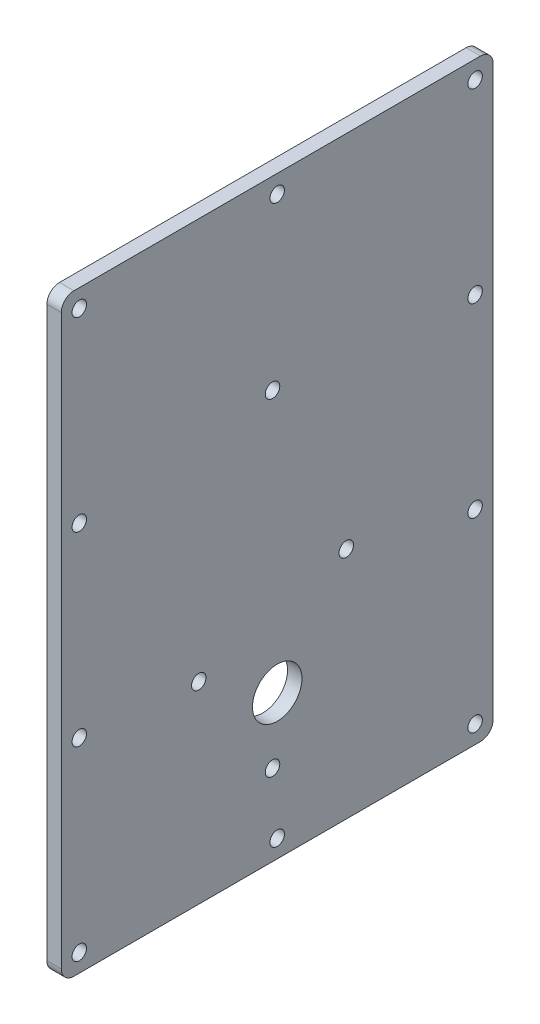
ISO-10303-21;
HEADER;
FILE_DESCRIPTION(('STEP AP214'),'2;1');
FILE_NAME('part.step','',(''),(''),'','','');
FILE_SCHEMA(('AUTOMOTIVE_DESIGN { 1 0 10303 214 1 1 1 1 }'));
ENDSEC;
DATA;
#1=APPLICATION_CONTEXT('core data for automotive mechanical design processes');
#2=APPLICATION_PROTOCOL_DEFINITION('international standard','automotive_design',2000,#1);
#3=PRODUCT_CONTEXT('',#1,'mechanical');
#4=PRODUCT('Part','Part','',(#3));
#5=PRODUCT_RELATED_PRODUCT_CATEGORY('part','',(#4));
#6=PRODUCT_DEFINITION_FORMATION('','',#4);
#7=PRODUCT_DEFINITION_CONTEXT('part definition',#1,'design');
#8=PRODUCT_DEFINITION('design','',#6,#7);
#9=PRODUCT_DEFINITION_SHAPE('','',#8);
#10=(LENGTH_UNIT() NAMED_UNIT(*) SI_UNIT(.MILLI.,.METRE.));
#11=(NAMED_UNIT(*) PLANE_ANGLE_UNIT() SI_UNIT($,.RADIAN.));
#12=(NAMED_UNIT(*) SI_UNIT($,.STERADIAN.) SOLID_ANGLE_UNIT());
#13=UNCERTAINTY_MEASURE_WITH_UNIT(LENGTH_MEASURE(1.E-05),#10,'distance_accuracy_value','');
#14=(GEOMETRIC_REPRESENTATION_CONTEXT(3) GLOBAL_UNCERTAINTY_ASSIGNED_CONTEXT((#13)) GLOBAL_UNIT_ASSIGNED_CONTEXT((#10,
#11,#12)) REPRESENTATION_CONTEXT('',''));
#15=CARTESIAN_POINT('',(0.,0.,0.));
#16=DIRECTION('',(0.,0.,1.));
#17=DIRECTION('',(1.,0.,0.));
#18=AXIS2_PLACEMENT_3D('',#15,#16,#17);
#19=CARTESIAN_POINT('',(0.,0.,0.));
#20=DIRECTION('',(-1.,0.,0.));
#21=DIRECTION('',(0.,0.,1.));
#22=AXIS2_PLACEMENT_3D('',#19,#20,#21);
#23=PLANE('',#22);
#24=CARTESIAN_POINT('',(0.,203.2,-6.35));
#25=DIRECTION('',(1.,0.,0.));
#26=DIRECTION('',(0.,0.,-1.));
#27=AXIS2_PLACEMENT_3D('',#24,#25,#26);
#28=CIRCLE('',#27,2.55269999999999);
#29=CARTESIAN_POINT('',(0.,203.2,-8.90269999999999));
#30=VERTEX_POINT('',#29);
#31=EDGE_CURVE('E265',#30,#30,#28,.T.);
#32=ORIENTED_EDGE('',*,*,#31,.T.);
#33=EDGE_LOOP('',(#32));
#34=FACE_BOUND('',#33,.T.);
#35=CARTESIAN_POINT('',(0.,6.35000000000003,-146.05));
#36=DIRECTION('',(1.,0.,0.));
#37=DIRECTION('',(0.,0.,-1.));
#38=AXIS2_PLACEMENT_3D('',#35,#36,#37);
#39=CIRCLE('',#38,2.5527);
#40=CARTESIAN_POINT('',(0.,6.35000000000003,-148.6027));
#41=VERTEX_POINT('',#40);
#42=EDGE_CURVE('E259',#41,#41,#39,.T.);
#43=ORIENTED_EDGE('',*,*,#42,.T.);
#44=EDGE_LOOP('',(#43));
#45=FACE_BOUND('',#44,.T.);
#46=DIRECTION('',(0.,0.,-1.));
#47=VECTOR('',#46,1.);
#48=CARTESIAN_POINT('',(0.,0.,0.));
#49=LINE('',#48,#47);
#50=CARTESIAN_POINT('',(0.,0.,-4.445));
#51=VERTEX_POINT('',#50);
#52=CARTESIAN_POINT('',(0.,0.,-147.955));
#53=VERTEX_POINT('',#52);
#54=EDGE_CURVE('E122',#51,#53,#49,.T.);
#55=ORIENTED_EDGE('',*,*,#54,.F.);
#56=CARTESIAN_POINT('',(0.,4.445,-4.445));
#57=DIRECTION('',(-1.,0.,0.));
#58=DIRECTION('',(0.,0.,1.));
#59=AXIS2_PLACEMENT_3D('',#56,#57,#58);
#60=CIRCLE('',#59,4.445);
#61=CARTESIAN_POINT('',(0.,4.445,0.));
#62=VERTEX_POINT('',#61);
#63=EDGE_CURVE('E105',#51,#62,#60,.T.);
#64=ORIENTED_EDGE('',*,*,#63,.T.);
#65=DIRECTION('',(0.,-1.,0.));
#66=VECTOR('',#65,1.);
#67=CARTESIAN_POINT('',(0.,0.,0.));
#68=LINE('',#67,#66);
#69=CARTESIAN_POINT('',(0.,205.105,0.));
#70=VERTEX_POINT('',#69);
#71=EDGE_CURVE('E132',#70,#62,#68,.T.);
#72=ORIENTED_EDGE('',*,*,#71,.F.);
#73=CARTESIAN_POINT('',(0.,205.105,-4.445));
#74=DIRECTION('',(-1.,0.,0.));
#75=DIRECTION('',(0.,0.,1.));
#76=AXIS2_PLACEMENT_3D('',#73,#74,#75);
#77=CIRCLE('',#76,4.445);
#78=CARTESIAN_POINT('',(0.,209.55,-4.445));
#79=VERTEX_POINT('',#78);
#80=EDGE_CURVE('E126',#70,#79,#77,.T.);
#81=ORIENTED_EDGE('',*,*,#80,.T.);
#82=DIRECTION('',(0.,0.,1.));
#83=VECTOR('',#82,1.);
#84=CARTESIAN_POINT('',(0.,209.55,0.));
#85=LINE('',#84,#83);
#86=CARTESIAN_POINT('',(0.,209.55,-147.955));
#87=VERTEX_POINT('',#86);
#88=EDGE_CURVE('E135',#87,#79,#85,.T.);
#89=ORIENTED_EDGE('',*,*,#88,.F.);
#90=CARTESIAN_POINT('',(0.,205.105,-147.955));
#91=DIRECTION('',(-1.,0.,0.));
#92=DIRECTION('',(0.,0.,1.));
#93=AXIS2_PLACEMENT_3D('',#90,#91,#92);
#94=CIRCLE('',#93,4.445);
#95=CARTESIAN_POINT('',(0.,205.105,-152.4));
#96=VERTEX_POINT('',#95);
#97=EDGE_CURVE('E146',#87,#96,#94,.T.);
#98=ORIENTED_EDGE('',*,*,#97,.T.);
#99=DIRECTION('',(0.,1.,0.));
#100=VECTOR('',#99,1.);
#101=CARTESIAN_POINT('',(0.,0.,-152.4));
#102=LINE('',#101,#100);
#103=CARTESIAN_POINT('',(0.,4.445,-152.4));
#104=VERTEX_POINT('',#103);
#105=EDGE_CURVE('E131',#104,#96,#102,.T.);
#106=ORIENTED_EDGE('',*,*,#105,.F.);
#107=CARTESIAN_POINT('',(0.,4.445,-147.955));
#108=DIRECTION('',(-1.,0.,0.));
#109=DIRECTION('',(0.,0.,1.));
#110=AXIS2_PLACEMENT_3D('',#107,#108,#109);
#111=CIRCLE('',#110,4.445);
#112=EDGE_CURVE('E116',#104,#53,#111,.T.);
#113=ORIENTED_EDGE('',*,*,#112,.T.);
#114=EDGE_LOOP('',(#55,#64,#72,#81,#89,#98,#106,#113));
#115=FACE_BOUND('',#114,.T.);
#116=CARTESIAN_POINT('',(0.,50.8000000000041,-76.2));
#117=DIRECTION('',(1.,0.,0.));
#118=DIRECTION('',(0.,0.,-1.));
#119=AXIS2_PLACEMENT_3D('',#116,#117,#118);
#120=CIRCLE('',#119,8.73125);
#121=CARTESIAN_POINT('',(0.,50.8000000000041,-84.93125));
#122=VERTEX_POINT('',#121);
#123=EDGE_CURVE('E137',#122,#122,#120,.T.);
#124=ORIENTED_EDGE('',*,*,#123,.T.);
#125=EDGE_LOOP('',(#124));
#126=FACE_BOUND('',#125,.T.);
#127=CARTESIAN_POINT('',(0.,28.5750000000041,-74.5553756248238));
#128=DIRECTION('',(1.,0.,0.));
#129=DIRECTION('',(0.,0.,-1.));
#130=AXIS2_PLACEMENT_3D('',#127,#128,#129);
#131=CIRCLE('',#130,2.5527);
#132=CARTESIAN_POINT('',(0.,28.5750000000041,-77.1080756248237));
#133=VERTEX_POINT('',#132);
#134=EDGE_CURVE('E185',#133,#133,#131,.T.);
#135=ORIENTED_EDGE('',*,*,#134,.T.);
#136=EDGE_LOOP('',(#135));
#137=FACE_BOUND('',#136,.T.);
#138=CARTESIAN_POINT('',(0.,82.5500000000041,-100.590375624824));
#139=DIRECTION('',(1.,0.,0.));
#140=DIRECTION('',(0.,0.,-1.));
#141=AXIS2_PLACEMENT_3D('',#138,#139,#140);
#142=CIRCLE('',#141,2.55270000000001);
#143=CARTESIAN_POINT('',(0.,82.5500000000041,-103.143075624824));
#144=VERTEX_POINT('',#143);
#145=EDGE_CURVE('E193',#144,#144,#142,.T.);
#146=ORIENTED_EDGE('',*,*,#145,.T.);
#147=EDGE_LOOP('',(#146));
#148=FACE_BOUND('',#147,.T.);
#149=CARTESIAN_POINT('',(0.,144.106959494484,-74.5553756248238));
#150=DIRECTION('',(1.,0.,0.));
#151=DIRECTION('',(0.,0.,-1.));
#152=AXIS2_PLACEMENT_3D('',#149,#150,#151);
#153=CIRCLE('',#152,2.55269999999999);
#154=CARTESIAN_POINT('',(0.,144.106959494484,-77.1080756248237));
#155=VERTEX_POINT('',#154);
#156=EDGE_CURVE('E199',#155,#155,#153,.T.);
#157=ORIENTED_EDGE('',*,*,#156,.T.);
#158=EDGE_LOOP('',(#157));
#159=FACE_BOUND('',#158,.T.);
#160=CARTESIAN_POINT('',(0.,68.0466000000041,-48.5203756248237));
#161=DIRECTION('',(1.,0.,0.));
#162=DIRECTION('',(0.,0.,-1.));
#163=AXIS2_PLACEMENT_3D('',#160,#161,#162);
#164=CIRCLE('',#163,2.55270000000001);
#165=CARTESIAN_POINT('',(0.,68.0466000000041,-51.0730756248238));
#166=VERTEX_POINT('',#165);
#167=EDGE_CURVE('E205',#166,#166,#164,.T.);
#168=ORIENTED_EDGE('',*,*,#167,.T.);
#169=EDGE_LOOP('',(#168));
#170=FACE_BOUND('',#169,.T.);
#171=CARTESIAN_POINT('',(0.,137.583333333333,-146.05));
#172=DIRECTION('',(1.,0.,0.));
#173=DIRECTION('',(0.,0.,-1.));
#174=AXIS2_PLACEMENT_3D('',#171,#172,#173);
#175=CIRCLE('',#174,2.55269999999999);
#176=CARTESIAN_POINT('',(0.,137.583333333333,-148.6027));
#177=VERTEX_POINT('',#176);
#178=EDGE_CURVE('E211',#177,#177,#175,.T.);
#179=ORIENTED_EDGE('',*,*,#178,.T.);
#180=EDGE_LOOP('',(#179));
#181=FACE_BOUND('',#180,.T.);
#182=CARTESIAN_POINT('',(0.,71.9666666666667,-146.05));
#183=DIRECTION('',(1.,0.,0.));
#184=DIRECTION('',(0.,0.,-1.));
#185=AXIS2_PLACEMENT_3D('',#182,#183,#184);
#186=CIRCLE('',#185,2.55270000000001);
#187=CARTESIAN_POINT('',(0.,71.9666666666667,-148.6027));
#188=VERTEX_POINT('',#187);
#189=EDGE_CURVE('E217',#188,#188,#186,.T.);
#190=ORIENTED_EDGE('',*,*,#189,.T.);
#191=EDGE_LOOP('',(#190));
#192=FACE_BOUND('',#191,.T.);
#193=CARTESIAN_POINT('',(0.,71.9666666666667,-6.35000000000002));
#194=DIRECTION('',(1.,0.,0.));
#195=DIRECTION('',(0.,0.,-1.));
#196=AXIS2_PLACEMENT_3D('',#193,#194,#195);
#197=CIRCLE('',#196,2.55270000000001);
#198=CARTESIAN_POINT('',(0.,71.9666666666667,-8.90270000000002));
#199=VERTEX_POINT('',#198);
#200=EDGE_CURVE('E223',#199,#199,#197,.T.);
#201=ORIENTED_EDGE('',*,*,#200,.T.);
#202=EDGE_LOOP('',(#201));
#203=FACE_BOUND('',#202,.T.);
#204=CARTESIAN_POINT('',(0.,137.583333333333,-6.35000000000001));
#205=DIRECTION('',(1.,0.,0.));
#206=DIRECTION('',(0.,0.,-1.));
#207=AXIS2_PLACEMENT_3D('',#204,#205,#206);
#208=CIRCLE('',#207,2.55269999999999);
#209=CARTESIAN_POINT('',(0.,137.583333333333,-8.9027));
#210=VERTEX_POINT('',#209);
#211=EDGE_CURVE('E229',#210,#210,#208,.T.);
#212=ORIENTED_EDGE('',*,*,#211,.T.);
#213=EDGE_LOOP('',(#212));
#214=FACE_BOUND('',#213,.T.);
#215=CARTESIAN_POINT('',(0.,203.2,-76.2));
#216=DIRECTION('',(1.,0.,0.));
#217=DIRECTION('',(0.,0.,-1.));
#218=AXIS2_PLACEMENT_3D('',#215,#216,#217);
#219=CIRCLE('',#218,2.55269999999999);
#220=CARTESIAN_POINT('',(0.,203.2,-78.7527));
#221=VERTEX_POINT('',#220);
#222=EDGE_CURVE('E235',#221,#221,#219,.T.);
#223=ORIENTED_EDGE('',*,*,#222,.T.);
#224=EDGE_LOOP('',(#223));
#225=FACE_BOUND('',#224,.T.);
#226=CARTESIAN_POINT('',(0.,6.35,-76.2));
#227=DIRECTION('',(1.,0.,0.));
#228=DIRECTION('',(0.,0.,-1.));
#229=AXIS2_PLACEMENT_3D('',#226,#227,#228);
#230=CIRCLE('',#229,2.5527);
#231=CARTESIAN_POINT('',(0.,6.35,-78.7527));
#232=VERTEX_POINT('',#231);
#233=EDGE_CURVE('E241',#232,#232,#230,.T.);
#234=ORIENTED_EDGE('',*,*,#233,.T.);
#235=EDGE_LOOP('',(#234));
#236=FACE_BOUND('',#235,.T.);
#237=CARTESIAN_POINT('',(0.,203.2,-146.05));
#238=DIRECTION('',(1.,0.,0.));
#239=DIRECTION('',(0.,0.,-1.));
#240=AXIS2_PLACEMENT_3D('',#237,#238,#239);
#241=CIRCLE('',#240,2.55269999999999);
#242=CARTESIAN_POINT('',(0.,203.2,-148.6027));
#243=VERTEX_POINT('',#242);
#244=EDGE_CURVE('E247',#243,#243,#241,.T.);
#245=ORIENTED_EDGE('',*,*,#244,.T.);
#246=EDGE_LOOP('',(#245));
#247=FACE_BOUND('',#246,.T.);
#248=CARTESIAN_POINT('',(0.,6.35,-6.35000000000003));
#249=DIRECTION('',(1.,0.,0.));
#250=DIRECTION('',(0.,0.,-1.));
#251=AXIS2_PLACEMENT_3D('',#248,#249,#250);
#252=CIRCLE('',#251,2.5527);
#253=CARTESIAN_POINT('',(0.,6.35,-8.90270000000003));
#254=VERTEX_POINT('',#253);
#255=EDGE_CURVE('E253',#254,#254,#252,.T.);
#256=ORIENTED_EDGE('',*,*,#255,.T.);
#257=EDGE_LOOP('',(#256));
#258=FACE_BOUND('',#257,.T.);
#259=ADVANCED_FACE('F39',(#34,#45,#115,#126,#137,#148,#159,#170,#181,#192,#203,#214,#225,#236,
#247,#258),#23,.T.);
#260=CARTESIAN_POINT('',(5.08,0.,0.));
#261=DIRECTION('',(-1.,0.,0.));
#262=DIRECTION('',(0.,0.,1.));
#263=AXIS2_PLACEMENT_3D('',#260,#261,#262);
#264=PLANE('',#263);
#265=CARTESIAN_POINT('',(5.08,203.2,-6.35));
#266=DIRECTION('',(1.,0.,0.));
#267=DIRECTION('',(0.,0.,-1.));
#268=AXIS2_PLACEMENT_3D('',#265,#266,#267);
#269=CIRCLE('',#268,2.55269999999999);
#270=CARTESIAN_POINT('',(5.08,203.2,-8.90269999999999));
#271=VERTEX_POINT('',#270);
#272=EDGE_CURVE('E268',#271,#271,#269,.T.);
#273=ORIENTED_EDGE('',*,*,#272,.F.);
#274=EDGE_LOOP('',(#273));
#275=FACE_BOUND('',#274,.T.);
#276=CARTESIAN_POINT('',(5.08,6.35000000000003,-146.05));
#277=DIRECTION('',(1.,0.,0.));
#278=DIRECTION('',(0.,0.,-1.));
#279=AXIS2_PLACEMENT_3D('',#276,#277,#278);
#280=CIRCLE('',#279,2.5527);
#281=CARTESIAN_POINT('',(5.08,6.35000000000003,-148.6027));
#282=VERTEX_POINT('',#281);
#283=EDGE_CURVE('E262',#282,#282,#280,.T.);
#284=ORIENTED_EDGE('',*,*,#283,.F.);
#285=EDGE_LOOP('',(#284));
#286=FACE_BOUND('',#285,.T.);
#287=CARTESIAN_POINT('',(5.08,6.35,-6.35000000000003));
#288=DIRECTION('',(1.,0.,0.));
#289=DIRECTION('',(0.,0.,-1.));
#290=AXIS2_PLACEMENT_3D('',#287,#288,#289);
#291=CIRCLE('',#290,2.5527);
#292=CARTESIAN_POINT('',(5.08,6.35,-8.90270000000003));
#293=VERTEX_POINT('',#292);
#294=EDGE_CURVE('E256',#293,#293,#291,.T.);
#295=ORIENTED_EDGE('',*,*,#294,.F.);
#296=EDGE_LOOP('',(#295));
#297=FACE_BOUND('',#296,.T.);
#298=CARTESIAN_POINT('',(5.08,203.2,-146.05));
#299=DIRECTION('',(1.,0.,0.));
#300=DIRECTION('',(0.,0.,-1.));
#301=AXIS2_PLACEMENT_3D('',#298,#299,#300);
#302=CIRCLE('',#301,2.55269999999999);
#303=CARTESIAN_POINT('',(5.08,203.2,-148.6027));
#304=VERTEX_POINT('',#303);
#305=EDGE_CURVE('E250',#304,#304,#302,.T.);
#306=ORIENTED_EDGE('',*,*,#305,.F.);
#307=EDGE_LOOP('',(#306));
#308=FACE_BOUND('',#307,.T.);
#309=CARTESIAN_POINT('',(5.08,6.35,-76.2));
#310=DIRECTION('',(1.,0.,0.));
#311=DIRECTION('',(0.,0.,-1.));
#312=AXIS2_PLACEMENT_3D('',#309,#310,#311);
#313=CIRCLE('',#312,2.5527);
#314=CARTESIAN_POINT('',(5.08,6.35,-78.7527));
#315=VERTEX_POINT('',#314);
#316=EDGE_CURVE('E244',#315,#315,#313,.T.);
#317=ORIENTED_EDGE('',*,*,#316,.F.);
#318=EDGE_LOOP('',(#317));
#319=FACE_BOUND('',#318,.T.);
#320=CARTESIAN_POINT('',(5.08,203.2,-76.2));
#321=DIRECTION('',(1.,0.,0.));
#322=DIRECTION('',(0.,0.,-1.));
#323=AXIS2_PLACEMENT_3D('',#320,#321,#322);
#324=CIRCLE('',#323,2.55269999999999);
#325=CARTESIAN_POINT('',(5.08,203.2,-78.7527));
#326=VERTEX_POINT('',#325);
#327=EDGE_CURVE('E238',#326,#326,#324,.T.);
#328=ORIENTED_EDGE('',*,*,#327,.F.);
#329=EDGE_LOOP('',(#328));
#330=FACE_BOUND('',#329,.T.);
#331=CARTESIAN_POINT('',(5.08,137.583333333333,-6.35000000000001));
#332=DIRECTION('',(1.,0.,0.));
#333=DIRECTION('',(0.,0.,-1.));
#334=AXIS2_PLACEMENT_3D('',#331,#332,#333);
#335=CIRCLE('',#334,2.55269999999999);
#336=CARTESIAN_POINT('',(5.08,137.583333333333,-8.9027));
#337=VERTEX_POINT('',#336);
#338=EDGE_CURVE('E232',#337,#337,#335,.T.);
#339=ORIENTED_EDGE('',*,*,#338,.F.);
#340=EDGE_LOOP('',(#339));
#341=FACE_BOUND('',#340,.T.);
#342=CARTESIAN_POINT('',(5.08,71.9666666666667,-6.35000000000002));
#343=DIRECTION('',(1.,0.,0.));
#344=DIRECTION('',(0.,0.,-1.));
#345=AXIS2_PLACEMENT_3D('',#342,#343,#344);
#346=CIRCLE('',#345,2.55270000000001);
#347=CARTESIAN_POINT('',(5.08,71.9666666666667,-8.90270000000002));
#348=VERTEX_POINT('',#347);
#349=EDGE_CURVE('E226',#348,#348,#346,.T.);
#350=ORIENTED_EDGE('',*,*,#349,.F.);
#351=EDGE_LOOP('',(#350));
#352=FACE_BOUND('',#351,.T.);
#353=CARTESIAN_POINT('',(5.08,71.9666666666667,-146.05));
#354=DIRECTION('',(1.,0.,0.));
#355=DIRECTION('',(0.,0.,-1.));
#356=AXIS2_PLACEMENT_3D('',#353,#354,#355);
#357=CIRCLE('',#356,2.55270000000001);
#358=CARTESIAN_POINT('',(5.08,71.9666666666667,-148.6027));
#359=VERTEX_POINT('',#358);
#360=EDGE_CURVE('E220',#359,#359,#357,.T.);
#361=ORIENTED_EDGE('',*,*,#360,.F.);
#362=EDGE_LOOP('',(#361));
#363=FACE_BOUND('',#362,.T.);
#364=CARTESIAN_POINT('',(5.08,68.0466000000041,-48.5203756248237));
#365=DIRECTION('',(1.,0.,0.));
#366=DIRECTION('',(0.,0.,-1.));
#367=AXIS2_PLACEMENT_3D('',#364,#365,#366);
#368=CIRCLE('',#367,2.55270000000001);
#369=CARTESIAN_POINT('',(5.08,68.0466000000041,-51.0730756248238));
#370=VERTEX_POINT('',#369);
#371=EDGE_CURVE('E208',#370,#370,#368,.T.);
#372=ORIENTED_EDGE('',*,*,#371,.F.);
#373=EDGE_LOOP('',(#372));
#374=FACE_BOUND('',#373,.T.);
#375=CARTESIAN_POINT('',(5.08,144.106959494484,-74.5553756248238));
#376=DIRECTION('',(1.,0.,0.));
#377=DIRECTION('',(0.,0.,-1.));
#378=AXIS2_PLACEMENT_3D('',#375,#376,#377);
#379=CIRCLE('',#378,2.55269999999999);
#380=CARTESIAN_POINT('',(5.08,144.106959494484,-77.1080756248237));
#381=VERTEX_POINT('',#380);
#382=EDGE_CURVE('E202',#381,#381,#379,.T.);
#383=ORIENTED_EDGE('',*,*,#382,.F.);
#384=EDGE_LOOP('',(#383));
#385=FACE_BOUND('',#384,.T.);
#386=CARTESIAN_POINT('',(5.08,82.5500000000041,-100.590375624824));
#387=DIRECTION('',(1.,0.,0.));
#388=DIRECTION('',(0.,0.,-1.));
#389=AXIS2_PLACEMENT_3D('',#386,#387,#388);
#390=CIRCLE('',#389,2.55270000000001);
#391=CARTESIAN_POINT('',(5.08,82.5500000000041,-103.143075624824));
#392=VERTEX_POINT('',#391);
#393=EDGE_CURVE('E196',#392,#392,#390,.T.);
#394=ORIENTED_EDGE('',*,*,#393,.F.);
#395=EDGE_LOOP('',(#394));
#396=FACE_BOUND('',#395,.T.);
#397=CARTESIAN_POINT('',(5.08,28.5750000000041,-74.5553756248238));
#398=DIRECTION('',(1.,0.,0.));
#399=DIRECTION('',(0.,0.,-1.));
#400=AXIS2_PLACEMENT_3D('',#397,#398,#399);
#401=CIRCLE('',#400,2.5527);
#402=CARTESIAN_POINT('',(5.08,28.5750000000041,-77.1080756248237));
#403=VERTEX_POINT('',#402);
#404=EDGE_CURVE('E190',#403,#403,#401,.T.);
#405=ORIENTED_EDGE('',*,*,#404,.F.);
#406=EDGE_LOOP('',(#405));
#407=FACE_BOUND('',#406,.T.);
#408=CARTESIAN_POINT('',(5.08,50.8000000000041,-76.2));
#409=DIRECTION('',(1.,0.,0.));
#410=DIRECTION('',(0.,0.,-1.));
#411=AXIS2_PLACEMENT_3D('',#408,#409,#410);
#412=CIRCLE('',#411,8.73125);
#413=CARTESIAN_POINT('',(5.08,50.8000000000041,-84.93125));
#414=VERTEX_POINT('',#413);
#415=EDGE_CURVE('E182',#414,#414,#412,.T.);
#416=ORIENTED_EDGE('',*,*,#415,.F.);
#417=EDGE_LOOP('',(#416));
#418=FACE_BOUND('',#417,.T.);
#419=DIRECTION('',(0.,-1.,0.));
#420=VECTOR('',#419,1.);
#421=CARTESIAN_POINT('',(5.08,0.,0.));
#422=LINE('',#421,#420);
#423=CARTESIAN_POINT('',(5.08,205.105,0.));
#424=VERTEX_POINT('',#423);
#425=CARTESIAN_POINT('',(5.08,4.445,0.));
#426=VERTEX_POINT('',#425);
#427=EDGE_CURVE('E142',#424,#426,#422,.T.);
#428=ORIENTED_EDGE('',*,*,#427,.T.);
#429=CARTESIAN_POINT('',(5.08,4.445,-4.445));
#430=DIRECTION('',(-1.,0.,0.));
#431=DIRECTION('',(0.,0.,1.));
#432=AXIS2_PLACEMENT_3D('',#429,#430,#431);
#433=CIRCLE('',#432,4.445);
#434=CARTESIAN_POINT('',(5.08,0.,-4.445));
#435=VERTEX_POINT('',#434);
#436=EDGE_CURVE('E157',#426,#435,#433,.F.);
#437=ORIENTED_EDGE('',*,*,#436,.T.);
#438=DIRECTION('',(0.,0.,-1.));
#439=VECTOR('',#438,1.);
#440=CARTESIAN_POINT('',(5.08,0.,0.));
#441=LINE('',#440,#439);
#442=CARTESIAN_POINT('',(5.08,0.,-147.955));
#443=VERTEX_POINT('',#442);
#444=EDGE_CURVE('E125',#435,#443,#441,.T.);
#445=ORIENTED_EDGE('',*,*,#444,.T.);
#446=CARTESIAN_POINT('',(5.08,4.445,-147.955));
#447=DIRECTION('',(-1.,0.,0.));
#448=DIRECTION('',(0.,0.,1.));
#449=AXIS2_PLACEMENT_3D('',#446,#447,#448);
#450=CIRCLE('',#449,4.445);
#451=CARTESIAN_POINT('',(5.08,4.445,-152.4));
#452=VERTEX_POINT('',#451);
#453=EDGE_CURVE('E155',#443,#452,#450,.F.);
#454=ORIENTED_EDGE('',*,*,#453,.T.);
#455=DIRECTION('',(0.,1.,0.));
#456=VECTOR('',#455,1.);
#457=CARTESIAN_POINT('',(5.08,0.,-152.4));
#458=LINE('',#457,#456);
#459=CARTESIAN_POINT('',(5.08,205.105,-152.4));
#460=VERTEX_POINT('',#459);
#461=EDGE_CURVE('E168',#452,#460,#458,.T.);
#462=ORIENTED_EDGE('',*,*,#461,.T.);
#463=CARTESIAN_POINT('',(5.08,205.105,-147.955));
#464=DIRECTION('',(-1.,0.,0.));
#465=DIRECTION('',(0.,0.,1.));
#466=AXIS2_PLACEMENT_3D('',#463,#464,#465);
#467=CIRCLE('',#466,4.445);
#468=CARTESIAN_POINT('',(5.08,209.55,-147.955));
#469=VERTEX_POINT('',#468);
#470=EDGE_CURVE('E60',#460,#469,#467,.F.);
#471=ORIENTED_EDGE('',*,*,#470,.T.);
#472=DIRECTION('',(0.,0.,1.));
#473=VECTOR('',#472,1.);
#474=CARTESIAN_POINT('',(5.08,209.55,0.));
#475=LINE('',#474,#473);
#476=CARTESIAN_POINT('',(5.08,209.55,-4.445));
#477=VERTEX_POINT('',#476);
#478=EDGE_CURVE('E143',#469,#477,#475,.T.);
#479=ORIENTED_EDGE('',*,*,#478,.T.);
#480=CARTESIAN_POINT('',(5.08,205.105,-4.445));
#481=DIRECTION('',(-1.,0.,0.));
#482=DIRECTION('',(0.,0.,1.));
#483=AXIS2_PLACEMENT_3D('',#480,#481,#482);
#484=CIRCLE('',#483,4.445);
#485=EDGE_CURVE('E152',#477,#424,#484,.F.);
#486=ORIENTED_EDGE('',*,*,#485,.T.);
#487=EDGE_LOOP('',(#428,#437,#445,#454,#462,#471,#479,#486));
#488=FACE_BOUND('',#487,.T.);
#489=CARTESIAN_POINT('',(5.08,137.583333333333,-146.05));
#490=DIRECTION('',(1.,0.,0.));
#491=DIRECTION('',(0.,0.,-1.));
#492=AXIS2_PLACEMENT_3D('',#489,#490,#491);
#493=CIRCLE('',#492,2.55269999999999);
#494=CARTESIAN_POINT('',(5.08,137.583333333333,-148.6027));
#495=VERTEX_POINT('',#494);
#496=EDGE_CURVE('E214',#495,#495,#493,.T.);
#497=ORIENTED_EDGE('',*,*,#496,.F.);
#498=EDGE_LOOP('',(#497));
#499=FACE_BOUND('',#498,.T.);
#500=ADVANCED_FACE('F274',(#275,#286,#297,#308,#319,#330,#341,#352,#363,#374,#385,#396,#407,
#418,#488,#499),#264,.F.);
#501=CARTESIAN_POINT('',(5.08,0.,0.));
#502=DIRECTION('',(0.,0.,-1.));
#503=DIRECTION('',(-1.,0.,0.));
#504=AXIS2_PLACEMENT_3D('',#501,#502,#503);
#505=PLANE('',#504);
#506=ORIENTED_EDGE('',*,*,#71,.T.);
#507=DIRECTION('',(-1.,0.,0.));
#508=VECTOR('',#507,1.);
#509=CARTESIAN_POINT('',(5.08,4.445,0.));
#510=LINE('',#509,#508);
#511=EDGE_CURVE('E110',#62,#426,#510,.F.);
#512=ORIENTED_EDGE('',*,*,#511,.T.);
#513=ORIENTED_EDGE('',*,*,#427,.F.);
#514=DIRECTION('',(-1.,0.,0.));
#515=VECTOR('',#514,1.);
#516=CARTESIAN_POINT('',(5.08,205.105,0.));
#517=LINE('',#516,#515);
#518=EDGE_CURVE('E115',#424,#70,#517,.T.);
#519=ORIENTED_EDGE('',*,*,#518,.T.);
#520=EDGE_LOOP('',(#506,#512,#513,#519));
#521=FACE_BOUND('',#520,.T.);
#522=ADVANCED_FACE('F277',(#521),#505,.F.);
#523=CARTESIAN_POINT('',(5.08,0.,0.));
#524=DIRECTION('',(0.,1.,0.));
#525=DIRECTION('',(0.,0.,1.));
#526=AXIS2_PLACEMENT_3D('',#523,#524,#525);
#527=PLANE('',#526);
#528=ORIENTED_EDGE('',*,*,#444,.F.);
#529=DIRECTION('',(-1.,0.,0.));
#530=VECTOR('',#529,1.);
#531=CARTESIAN_POINT('',(5.08,0.,-4.445));
#532=LINE('',#531,#530);
#533=EDGE_CURVE('E109',#435,#51,#532,.T.);
#534=ORIENTED_EDGE('',*,*,#533,.T.);
#535=ORIENTED_EDGE('',*,*,#54,.T.);
#536=DIRECTION('',(-1.,0.,0.));
#537=VECTOR('',#536,1.);
#538=CARTESIAN_POINT('',(5.08,0.,-147.955));
#539=LINE('',#538,#537);
#540=EDGE_CURVE('E127',#53,#443,#539,.F.);
#541=ORIENTED_EDGE('',*,*,#540,.T.);
#542=EDGE_LOOP('',(#528,#534,#535,#541));
#543=FACE_BOUND('',#542,.T.);
#544=ADVANCED_FACE('F121',(#543),#527,.F.);
#545=CARTESIAN_POINT('',(5.08,0.,-152.4));
#546=DIRECTION('',(0.,0.,1.));
#547=DIRECTION('',(1.,0.,0.));
#548=AXIS2_PLACEMENT_3D('',#545,#546,#547);
#549=PLANE('',#548);
#550=ORIENTED_EDGE('',*,*,#461,.F.);
#551=DIRECTION('',(-1.,0.,0.));
#552=VECTOR('',#551,1.);
#553=CARTESIAN_POINT('',(5.08,4.445,-152.4));
#554=LINE('',#553,#552);
#555=EDGE_CURVE('E161',#452,#104,#554,.T.);
#556=ORIENTED_EDGE('',*,*,#555,.T.);
#557=ORIENTED_EDGE('',*,*,#105,.T.);
#558=DIRECTION('',(-1.,0.,0.));
#559=VECTOR('',#558,1.);
#560=CARTESIAN_POINT('',(5.08,205.105,-152.4));
#561=LINE('',#560,#559);
#562=EDGE_CURVE('E159',#96,#460,#561,.F.);
#563=ORIENTED_EDGE('',*,*,#562,.T.);
#564=EDGE_LOOP('',(#550,#556,#557,#563));
#565=FACE_BOUND('',#564,.T.);
#566=ADVANCED_FACE('F166',(#565),#549,.F.);
#567=CARTESIAN_POINT('',(5.08,209.55,0.));
#568=DIRECTION('',(0.,-1.,0.));
#569=DIRECTION('',(0.,0.,-1.));
#570=AXIS2_PLACEMENT_3D('',#567,#568,#569);
#571=PLANE('',#570);
#572=ORIENTED_EDGE('',*,*,#478,.F.);
#573=DIRECTION('',(-1.,0.,0.));
#574=VECTOR('',#573,1.);
#575=CARTESIAN_POINT('',(5.08,209.55,-147.955));
#576=LINE('',#575,#574);
#577=EDGE_CURVE('E11',#469,#87,#576,.T.);
#578=ORIENTED_EDGE('',*,*,#577,.T.);
#579=ORIENTED_EDGE('',*,*,#88,.T.);
#580=DIRECTION('',(-1.,0.,0.));
#581=VECTOR('',#580,1.);
#582=CARTESIAN_POINT('',(5.08,209.55,-4.445));
#583=LINE('',#582,#581);
#584=EDGE_CURVE('E47',#79,#477,#583,.F.);
#585=ORIENTED_EDGE('',*,*,#584,.T.);
#586=EDGE_LOOP('',(#572,#578,#579,#585));
#587=FACE_BOUND('',#586,.T.);
#588=ADVANCED_FACE('F175',(#587),#571,.F.);
#589=CARTESIAN_POINT('',(0.,50.8000000000041,-76.2));
#590=DIRECTION('',(1.,0.,0.));
#591=DIRECTION('',(0.,0.,-1.));
#592=AXIS2_PLACEMENT_3D('',#589,#590,#591);
#593=CYLINDRICAL_SURFACE('',#592,8.73125);
#594=ORIENTED_EDGE('',*,*,#123,.F.);
#595=EDGE_LOOP('',(#594));
#596=FACE_BOUND('',#595,.T.);
#597=ORIENTED_EDGE('',*,*,#415,.T.);
#598=EDGE_LOOP('',(#597));
#599=FACE_BOUND('',#598,.T.);
#600=ADVANCED_FACE('F333',(#596,#599),#593,.F.);
#601=CARTESIAN_POINT('',(5.08,28.5750000000041,-74.5553756248238));
#602=DIRECTION('',(1.,0.,0.));
#603=DIRECTION('',(0.,0.,-1.));
#604=AXIS2_PLACEMENT_3D('',#601,#602,#603);
#605=CYLINDRICAL_SURFACE('',#604,2.5527);
#606=ORIENTED_EDGE('',*,*,#134,.F.);
#607=EDGE_LOOP('',(#606));
#608=FACE_BOUND('',#607,.T.);
#609=ORIENTED_EDGE('',*,*,#404,.T.);
#610=EDGE_LOOP('',(#609));
#611=FACE_BOUND('',#610,.T.);
#612=ADVANCED_FACE('F500',(#608,#611),#605,.F.);
#613=CARTESIAN_POINT('',(5.08,82.5500000000041,-100.590375624824));
#614=DIRECTION('',(1.,0.,0.));
#615=DIRECTION('',(0.,0.,-1.));
#616=AXIS2_PLACEMENT_3D('',#613,#614,#615);
#617=CYLINDRICAL_SURFACE('',#616,2.55270000000001);
#618=ORIENTED_EDGE('',*,*,#145,.F.);
#619=EDGE_LOOP('',(#618));
#620=FACE_BOUND('',#619,.T.);
#621=ORIENTED_EDGE('',*,*,#393,.T.);
#622=EDGE_LOOP('',(#621));
#623=FACE_BOUND('',#622,.T.);
#624=ADVANCED_FACE('F507',(#620,#623),#617,.F.);
#625=CARTESIAN_POINT('',(5.08,144.106959494484,-74.5553756248238));
#626=DIRECTION('',(1.,0.,0.));
#627=DIRECTION('',(0.,0.,-1.));
#628=AXIS2_PLACEMENT_3D('',#625,#626,#627);
#629=CYLINDRICAL_SURFACE('',#628,2.55269999999999);
#630=ORIENTED_EDGE('',*,*,#156,.F.);
#631=EDGE_LOOP('',(#630));
#632=FACE_BOUND('',#631,.T.);
#633=ORIENTED_EDGE('',*,*,#382,.T.);
#634=EDGE_LOOP('',(#633));
#635=FACE_BOUND('',#634,.T.);
#636=ADVANCED_FACE('F515',(#632,#635),#629,.F.);
#637=CARTESIAN_POINT('',(5.08,68.0466000000041,-48.5203756248237));
#638=DIRECTION('',(1.,0.,0.));
#639=DIRECTION('',(0.,0.,-1.));
#640=AXIS2_PLACEMENT_3D('',#637,#638,#639);
#641=CYLINDRICAL_SURFACE('',#640,2.55270000000001);
#642=ORIENTED_EDGE('',*,*,#167,.F.);
#643=EDGE_LOOP('',(#642));
#644=FACE_BOUND('',#643,.T.);
#645=ORIENTED_EDGE('',*,*,#371,.T.);
#646=EDGE_LOOP('',(#645));
#647=FACE_BOUND('',#646,.T.);
#648=ADVANCED_FACE('F344',(#644,#647),#641,.F.);
#649=CARTESIAN_POINT('',(5.08,4.445,-4.445));
#650=DIRECTION('',(-1.,0.,0.));
#651=DIRECTION('',(0.,0.,1.));
#652=AXIS2_PLACEMENT_3D('',#649,#650,#651);
#653=CYLINDRICAL_SURFACE('',#652,4.445);
#654=ORIENTED_EDGE('',*,*,#436,.F.);
#655=ORIENTED_EDGE('',*,*,#511,.F.);
#656=ORIENTED_EDGE('',*,*,#63,.F.);
#657=ORIENTED_EDGE('',*,*,#533,.F.);
#658=EDGE_LOOP('',(#654,#655,#656,#657));
#659=FACE_BOUND('',#658,.T.);
#660=ADVANCED_FACE('F108',(#659),#653,.T.);
#661=CARTESIAN_POINT('',(5.08,4.445,-147.955));
#662=DIRECTION('',(-1.,0.,0.));
#663=DIRECTION('',(0.,0.,1.));
#664=AXIS2_PLACEMENT_3D('',#661,#662,#663);
#665=CYLINDRICAL_SURFACE('',#664,4.445);
#666=ORIENTED_EDGE('',*,*,#453,.F.);
#667=ORIENTED_EDGE('',*,*,#540,.F.);
#668=ORIENTED_EDGE('',*,*,#112,.F.);
#669=ORIENTED_EDGE('',*,*,#555,.F.);
#670=EDGE_LOOP('',(#666,#667,#668,#669));
#671=FACE_BOUND('',#670,.T.);
#672=ADVANCED_FACE('F343',(#671),#665,.T.);
#673=CARTESIAN_POINT('',(5.08,205.105,-147.955));
#674=DIRECTION('',(-1.,0.,0.));
#675=DIRECTION('',(0.,0.,1.));
#676=AXIS2_PLACEMENT_3D('',#673,#674,#675);
#677=CYLINDRICAL_SURFACE('',#676,4.445);
#678=ORIENTED_EDGE('',*,*,#470,.F.);
#679=ORIENTED_EDGE('',*,*,#562,.F.);
#680=ORIENTED_EDGE('',*,*,#97,.F.);
#681=ORIENTED_EDGE('',*,*,#577,.F.);
#682=EDGE_LOOP('',(#678,#679,#680,#681));
#683=FACE_BOUND('',#682,.T.);
#684=ADVANCED_FACE('F174',(#683),#677,.T.);
#685=CARTESIAN_POINT('',(5.08,205.105,-4.445));
#686=DIRECTION('',(-1.,0.,0.));
#687=DIRECTION('',(0.,0.,1.));
#688=AXIS2_PLACEMENT_3D('',#685,#686,#687);
#689=CYLINDRICAL_SURFACE('',#688,4.445);
#690=ORIENTED_EDGE('',*,*,#485,.F.);
#691=ORIENTED_EDGE('',*,*,#584,.F.);
#692=ORIENTED_EDGE('',*,*,#80,.F.);
#693=ORIENTED_EDGE('',*,*,#518,.F.);
#694=EDGE_LOOP('',(#690,#691,#692,#693));
#695=FACE_BOUND('',#694,.T.);
#696=ADVANCED_FACE('F41',(#695),#689,.T.);
#697=CARTESIAN_POINT('',(5.08,137.583333333333,-146.05));
#698=DIRECTION('',(1.,0.,0.));
#699=DIRECTION('',(0.,0.,-1.));
#700=AXIS2_PLACEMENT_3D('',#697,#698,#699);
#701=CYLINDRICAL_SURFACE('',#700,2.55269999999999);
#702=ORIENTED_EDGE('',*,*,#178,.F.);
#703=EDGE_LOOP('',(#702));
#704=FACE_BOUND('',#703,.T.);
#705=ORIENTED_EDGE('',*,*,#496,.T.);
#706=EDGE_LOOP('',(#705));
#707=FACE_BOUND('',#706,.T.);
#708=ADVANCED_FACE('F308',(#704,#707),#701,.F.);
#709=CARTESIAN_POINT('',(5.08,71.9666666666667,-146.05));
#710=DIRECTION('',(1.,0.,0.));
#711=DIRECTION('',(0.,0.,-1.));
#712=AXIS2_PLACEMENT_3D('',#709,#710,#711);
#713=CYLINDRICAL_SURFACE('',#712,2.55270000000001);
#714=ORIENTED_EDGE('',*,*,#189,.F.);
#715=EDGE_LOOP('',(#714));
#716=FACE_BOUND('',#715,.T.);
#717=ORIENTED_EDGE('',*,*,#360,.T.);
#718=EDGE_LOOP('',(#717));
#719=FACE_BOUND('',#718,.T.);
#720=ADVANCED_FACE('F310',(#716,#719),#713,.F.);
#721=CARTESIAN_POINT('',(5.08,71.9666666666667,-6.35000000000002));
#722=DIRECTION('',(1.,0.,0.));
#723=DIRECTION('',(0.,0.,-1.));
#724=AXIS2_PLACEMENT_3D('',#721,#722,#723);
#725=CYLINDRICAL_SURFACE('',#724,2.55270000000001);
#726=ORIENTED_EDGE('',*,*,#200,.F.);
#727=EDGE_LOOP('',(#726));
#728=FACE_BOUND('',#727,.T.);
#729=ORIENTED_EDGE('',*,*,#349,.T.);
#730=EDGE_LOOP('',(#729));
#731=FACE_BOUND('',#730,.T.);
#732=ADVANCED_FACE('F317',(#728,#731),#725,.F.);
#733=CARTESIAN_POINT('',(5.08,137.583333333333,-6.35000000000001));
#734=DIRECTION('',(1.,0.,0.));
#735=DIRECTION('',(0.,0.,-1.));
#736=AXIS2_PLACEMENT_3D('',#733,#734,#735);
#737=CYLINDRICAL_SURFACE('',#736,2.55269999999999);
#738=ORIENTED_EDGE('',*,*,#211,.F.);
#739=EDGE_LOOP('',(#738));
#740=FACE_BOUND('',#739,.T.);
#741=ORIENTED_EDGE('',*,*,#338,.T.);
#742=EDGE_LOOP('',(#741));
#743=FACE_BOUND('',#742,.T.);
#744=ADVANCED_FACE('F384',(#740,#743),#737,.F.);
#745=CARTESIAN_POINT('',(5.08,203.2,-76.2));
#746=DIRECTION('',(1.,0.,0.));
#747=DIRECTION('',(0.,0.,-1.));
#748=AXIS2_PLACEMENT_3D('',#745,#746,#747);
#749=CYLINDRICAL_SURFACE('',#748,2.55269999999999);
#750=ORIENTED_EDGE('',*,*,#222,.F.);
#751=EDGE_LOOP('',(#750));
#752=FACE_BOUND('',#751,.T.);
#753=ORIENTED_EDGE('',*,*,#327,.T.);
#754=EDGE_LOOP('',(#753));
#755=FACE_BOUND('',#754,.T.);
#756=ADVANCED_FACE('F394',(#752,#755),#749,.F.);
#757=CARTESIAN_POINT('',(5.08,6.35,-76.2));
#758=DIRECTION('',(1.,0.,0.));
#759=DIRECTION('',(0.,0.,-1.));
#760=AXIS2_PLACEMENT_3D('',#757,#758,#759);
#761=CYLINDRICAL_SURFACE('',#760,2.5527);
#762=ORIENTED_EDGE('',*,*,#233,.F.);
#763=EDGE_LOOP('',(#762));
#764=FACE_BOUND('',#763,.T.);
#765=ORIENTED_EDGE('',*,*,#316,.T.);
#766=EDGE_LOOP('',(#765));
#767=FACE_BOUND('',#766,.T.);
#768=ADVANCED_FACE('F404',(#764,#767),#761,.F.);
#769=CARTESIAN_POINT('',(5.08,203.2,-146.05));
#770=DIRECTION('',(1.,0.,0.));
#771=DIRECTION('',(0.,0.,-1.));
#772=AXIS2_PLACEMENT_3D('',#769,#770,#771);
#773=CYLINDRICAL_SURFACE('',#772,2.55269999999999);
#774=ORIENTED_EDGE('',*,*,#244,.F.);
#775=EDGE_LOOP('',(#774));
#776=FACE_BOUND('',#775,.T.);
#777=ORIENTED_EDGE('',*,*,#305,.T.);
#778=EDGE_LOOP('',(#777));
#779=FACE_BOUND('',#778,.T.);
#780=ADVANCED_FACE('F414',(#776,#779),#773,.F.);
#781=CARTESIAN_POINT('',(5.08,6.35,-6.35000000000003));
#782=DIRECTION('',(1.,0.,0.));
#783=DIRECTION('',(0.,0.,-1.));
#784=AXIS2_PLACEMENT_3D('',#781,#782,#783);
#785=CYLINDRICAL_SURFACE('',#784,2.5527);
#786=ORIENTED_EDGE('',*,*,#255,.F.);
#787=EDGE_LOOP('',(#786));
#788=FACE_BOUND('',#787,.T.);
#789=ORIENTED_EDGE('',*,*,#294,.T.);
#790=EDGE_LOOP('',(#789));
#791=FACE_BOUND('',#790,.T.);
#792=ADVANCED_FACE('F424',(#788,#791),#785,.F.);
#793=CARTESIAN_POINT('',(5.08,6.35000000000003,-146.05));
#794=DIRECTION('',(1.,0.,0.));
#795=DIRECTION('',(0.,0.,-1.));
#796=AXIS2_PLACEMENT_3D('',#793,#794,#795);
#797=CYLINDRICAL_SURFACE('',#796,2.5527);
#798=ORIENTED_EDGE('',*,*,#42,.F.);
#799=EDGE_LOOP('',(#798));
#800=FACE_BOUND('',#799,.T.);
#801=ORIENTED_EDGE('',*,*,#283,.T.);
#802=EDGE_LOOP('',(#801));
#803=FACE_BOUND('',#802,.T.);
#804=ADVANCED_FACE('F434',(#800,#803),#797,.F.);
#805=CARTESIAN_POINT('',(5.08,203.2,-6.35));
#806=DIRECTION('',(1.,0.,0.));
#807=DIRECTION('',(0.,0.,-1.));
#808=AXIS2_PLACEMENT_3D('',#805,#806,#807);
#809=CYLINDRICAL_SURFACE('',#808,2.55269999999999);
#810=ORIENTED_EDGE('',*,*,#31,.F.);
#811=EDGE_LOOP('',(#810));
#812=FACE_BOUND('',#811,.T.);
#813=ORIENTED_EDGE('',*,*,#272,.T.);
#814=EDGE_LOOP('',(#813));
#815=FACE_BOUND('',#814,.T.);
#816=ADVANCED_FACE('F272',(#812,#815),#809,.F.);
#817=CLOSED_SHELL('',(#259,#500,#522,#544,#566,#588,#600,#612,#624,#636,#648,#660,#672,#684,
#696,#708,#720,#732,#744,#756,#768,#780,#792,#804,#816));
#818=MANIFOLD_SOLID_BREP('B2',#817);
#819=ADVANCED_BREP_SHAPE_REPRESENTATION('',(#18,#818),#14);
#820=SHAPE_DEFINITION_REPRESENTATION(#9,#819);
ENDSEC;
END-ISO-10303-21;
